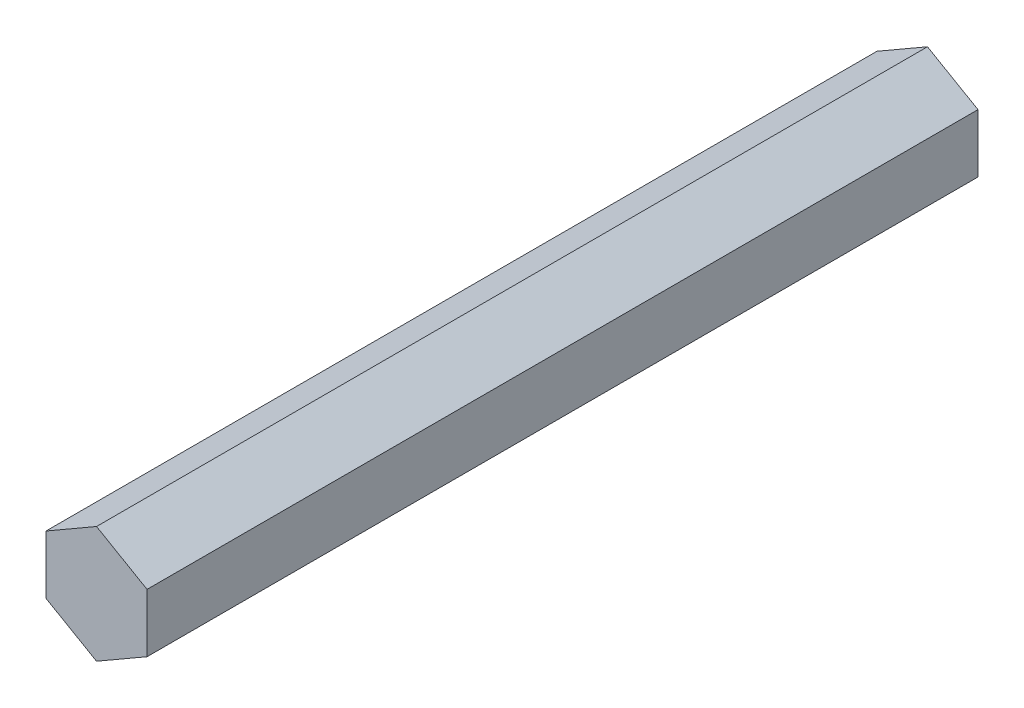
ISO-10303-21;
HEADER;
FILE_DESCRIPTION(('STEP AP214'),'2;1');
FILE_NAME('part.step','',(''),(''),'','','');
FILE_SCHEMA(('AUTOMOTIVE_DESIGN { 1 0 10303 214 1 1 1 1 }'));
ENDSEC;
DATA;
#1=APPLICATION_CONTEXT('core data for automotive mechanical design processes');
#2=APPLICATION_PROTOCOL_DEFINITION('international standard','automotive_design',2000,#1);
#3=PRODUCT_CONTEXT('',#1,'mechanical');
#4=PRODUCT('Part','Part','',(#3));
#5=PRODUCT_RELATED_PRODUCT_CATEGORY('part','',(#4));
#6=PRODUCT_DEFINITION_FORMATION('','',#4);
#7=PRODUCT_DEFINITION_CONTEXT('part definition',#1,'design');
#8=PRODUCT_DEFINITION('design','',#6,#7);
#9=PRODUCT_DEFINITION_SHAPE('','',#8);
#10=(LENGTH_UNIT() NAMED_UNIT(*) SI_UNIT(.MILLI.,.METRE.));
#11=(NAMED_UNIT(*) PLANE_ANGLE_UNIT() SI_UNIT($,.RADIAN.));
#12=(NAMED_UNIT(*) SI_UNIT($,.STERADIAN.) SOLID_ANGLE_UNIT());
#13=UNCERTAINTY_MEASURE_WITH_UNIT(LENGTH_MEASURE(1.E-05),#10,'distance_accuracy_value','');
#14=(GEOMETRIC_REPRESENTATION_CONTEXT(3) GLOBAL_UNCERTAINTY_ASSIGNED_CONTEXT((#13)) GLOBAL_UNIT_ASSIGNED_CONTEXT((#10,
#11,#12)) REPRESENTATION_CONTEXT('',''));
#15=CARTESIAN_POINT('',(0.,0.,0.));
#16=DIRECTION('',(0.,0.,1.));
#17=DIRECTION('',(1.,0.,0.));
#18=AXIS2_PLACEMENT_3D('',#15,#16,#17);
#19=CARTESIAN_POINT('',(2.25,0.,18.5));
#20=DIRECTION('',(-1.,0.,0.));
#21=DIRECTION('',(0.,-1.,0.));
#22=AXIS2_PLACEMENT_3D('',#19,#20,#21);
#23=PLANE('',#22);
#24=DIRECTION('',(0.,0.,-1.));
#25=VECTOR('',#24,1.);
#26=CARTESIAN_POINT('',(2.25,-1.29903810567666,18.5));
#27=LINE('',#26,#25);
#28=CARTESIAN_POINT('',(2.25,-1.29903810567666,18.5));
#29=VERTEX_POINT('',#28);
#30=CARTESIAN_POINT('',(2.25,-1.29903810567666,-18.5));
#31=VERTEX_POINT('',#30);
#32=EDGE_CURVE('E102',#29,#31,#27,.T.);
#33=ORIENTED_EDGE('',*,*,#32,.T.);
#34=DIRECTION('',(0.,1.,0.));
#35=VECTOR('',#34,1.);
#36=CARTESIAN_POINT('',(2.25,0.,-18.5));
#37=LINE('',#36,#35);
#38=CARTESIAN_POINT('',(2.25,1.29903810567666,-18.5));
#39=VERTEX_POINT('',#38);
#40=EDGE_CURVE('E96',#31,#39,#37,.T.);
#41=ORIENTED_EDGE('',*,*,#40,.T.);
#42=DIRECTION('',(0.,0.,-1.));
#43=VECTOR('',#42,1.);
#44=CARTESIAN_POINT('',(2.25,1.29903810567666,18.5));
#45=LINE('',#44,#43);
#46=CARTESIAN_POINT('',(2.25,1.29903810567666,18.5));
#47=VERTEX_POINT('',#46);
#48=EDGE_CURVE('E11',#47,#39,#45,.T.);
#49=ORIENTED_EDGE('',*,*,#48,.F.);
#50=DIRECTION('',(0.,1.,0.));
#51=VECTOR('',#50,1.);
#52=CARTESIAN_POINT('',(2.25,0.,18.5));
#53=LINE('',#52,#51);
#54=EDGE_CURVE('E114',#29,#47,#53,.T.);
#55=ORIENTED_EDGE('',*,*,#54,.F.);
#56=EDGE_LOOP('',(#33,#41,#49,#55));
#57=FACE_BOUND('',#56,.T.);
#58=ADVANCED_FACE('F32',(#57),#23,.F.);
#59=CARTESIAN_POINT('',(1.125,1.94855715851499,18.5));
#60=DIRECTION('',(-0.499999999999999,-0.866025403784439,0.));
#61=DIRECTION('',(0.866025403784439,-0.499999999999999,0.));
#62=AXIS2_PLACEMENT_3D('',#59,#60,#61);
#63=PLANE('',#62);
#64=ORIENTED_EDGE('',*,*,#48,.T.);
#65=DIRECTION('',(-0.866025403784439,0.499999999999999,0.));
#66=VECTOR('',#65,1.);
#67=CARTESIAN_POINT('',(1.125,1.94855715851499,-18.5));
#68=LINE('',#67,#66);
#69=CARTESIAN_POINT('',(0.,2.59807621135332,-18.5));
#70=VERTEX_POINT('',#69);
#71=EDGE_CURVE('E86',#39,#70,#68,.T.);
#72=ORIENTED_EDGE('',*,*,#71,.T.);
#73=DIRECTION('',(0.,0.,-1.));
#74=VECTOR('',#73,1.);
#75=CARTESIAN_POINT('',(0.,2.59807621135332,18.5));
#76=LINE('',#75,#74);
#77=CARTESIAN_POINT('',(0.,2.59807621135332,18.5));
#78=VERTEX_POINT('',#77);
#79=EDGE_CURVE('E39',#78,#70,#76,.T.);
#80=ORIENTED_EDGE('',*,*,#79,.F.);
#81=DIRECTION('',(-0.866025403784439,0.499999999999999,0.));
#82=VECTOR('',#81,1.);
#83=CARTESIAN_POINT('',(1.125,1.94855715851499,18.5));
#84=LINE('',#83,#82);
#85=EDGE_CURVE('E87',#47,#78,#84,.T.);
#86=ORIENTED_EDGE('',*,*,#85,.F.);
#87=EDGE_LOOP('',(#64,#72,#80,#86));
#88=FACE_BOUND('',#87,.T.);
#89=ADVANCED_FACE('F84',(#88),#63,.F.);
#90=CARTESIAN_POINT('',(-1.125,1.94855715851499,18.5));
#91=DIRECTION('',(0.5,-0.866025403784438,0.));
#92=DIRECTION('',(0.866025403784439,0.5,0.));
#93=AXIS2_PLACEMENT_3D('',#90,#91,#92);
#94=PLANE('',#93);
#95=ORIENTED_EDGE('',*,*,#79,.T.);
#96=DIRECTION('',(-0.866025403784439,-0.5,0.));
#97=VECTOR('',#96,1.);
#98=CARTESIAN_POINT('',(-1.125,1.94855715851499,-18.5));
#99=LINE('',#98,#97);
#100=CARTESIAN_POINT('',(-2.25,1.29903810567666,-18.5));
#101=VERTEX_POINT('',#100);
#102=EDGE_CURVE('E100',#70,#101,#99,.T.);
#103=ORIENTED_EDGE('',*,*,#102,.T.);
#104=DIRECTION('',(0.,0.,-1.));
#105=VECTOR('',#104,1.);
#106=CARTESIAN_POINT('',(-2.25,1.29903810567666,18.5));
#107=LINE('',#106,#105);
#108=CARTESIAN_POINT('',(-2.25,1.29903810567666,18.5));
#109=VERTEX_POINT('',#108);
#110=EDGE_CURVE('E128',#109,#101,#107,.T.);
#111=ORIENTED_EDGE('',*,*,#110,.F.);
#112=DIRECTION('',(-0.866025403784439,-0.5,0.));
#113=VECTOR('',#112,1.);
#114=CARTESIAN_POINT('',(-1.125,1.94855715851499,18.5));
#115=LINE('',#114,#113);
#116=EDGE_CURVE('E117',#78,#109,#115,.T.);
#117=ORIENTED_EDGE('',*,*,#116,.F.);
#118=EDGE_LOOP('',(#95,#103,#111,#117));
#119=FACE_BOUND('',#118,.T.);
#120=ADVANCED_FACE('F131',(#119),#94,.F.);
#121=CARTESIAN_POINT('',(-2.25,0.,18.5));
#122=DIRECTION('',(1.,0.,0.));
#123=DIRECTION('',(0.,1.,0.));
#124=AXIS2_PLACEMENT_3D('',#121,#122,#123);
#125=PLANE('',#124);
#126=ORIENTED_EDGE('',*,*,#110,.T.);
#127=DIRECTION('',(0.,-1.,0.));
#128=VECTOR('',#127,1.);
#129=CARTESIAN_POINT('',(-2.25,0.,-18.5));
#130=LINE('',#129,#128);
#131=CARTESIAN_POINT('',(-2.25,-1.29903810567666,-18.5));
#132=VERTEX_POINT('',#131);
#133=EDGE_CURVE('E106',#101,#132,#130,.T.);
#134=ORIENTED_EDGE('',*,*,#133,.T.);
#135=DIRECTION('',(0.,0.,-1.));
#136=VECTOR('',#135,1.);
#137=CARTESIAN_POINT('',(-2.25,-1.29903810567666,18.5));
#138=LINE('',#137,#136);
#139=CARTESIAN_POINT('',(-2.25,-1.29903810567666,18.5));
#140=VERTEX_POINT('',#139);
#141=EDGE_CURVE('E126',#140,#132,#138,.T.);
#142=ORIENTED_EDGE('',*,*,#141,.F.);
#143=DIRECTION('',(0.,-1.,0.));
#144=VECTOR('',#143,1.);
#145=CARTESIAN_POINT('',(-2.25,0.,18.5));
#146=LINE('',#145,#144);
#147=EDGE_CURVE('E119',#109,#140,#146,.T.);
#148=ORIENTED_EDGE('',*,*,#147,.F.);
#149=EDGE_LOOP('',(#126,#134,#142,#148));
#150=FACE_BOUND('',#149,.T.);
#151=ADVANCED_FACE('F137',(#150),#125,.F.);
#152=CARTESIAN_POINT('',(-1.125,-1.94855715851499,18.5));
#153=DIRECTION('',(0.5,0.866025403784439,0.));
#154=DIRECTION('',(-0.866025403784439,0.5,0.));
#155=AXIS2_PLACEMENT_3D('',#152,#153,#154);
#156=PLANE('',#155);
#157=ORIENTED_EDGE('',*,*,#141,.T.);
#158=DIRECTION('',(0.866025403784439,-0.5,0.));
#159=VECTOR('',#158,1.);
#160=CARTESIAN_POINT('',(-1.125,-1.94855715851499,-18.5));
#161=LINE('',#160,#159);
#162=CARTESIAN_POINT('',(0.,-2.59807621135332,-18.5));
#163=VERTEX_POINT('',#162);
#164=EDGE_CURVE('E109',#132,#163,#161,.T.);
#165=ORIENTED_EDGE('',*,*,#164,.T.);
#166=DIRECTION('',(0.,0.,-1.));
#167=VECTOR('',#166,1.);
#168=CARTESIAN_POINT('',(0.,-2.59807621135332,18.5));
#169=LINE('',#168,#167);
#170=CARTESIAN_POINT('',(0.,-2.59807621135332,18.5));
#171=VERTEX_POINT('',#170);
#172=EDGE_CURVE('E124',#171,#163,#169,.T.);
#173=ORIENTED_EDGE('',*,*,#172,.F.);
#174=DIRECTION('',(0.866025403784439,-0.5,0.));
#175=VECTOR('',#174,1.);
#176=CARTESIAN_POINT('',(-1.125,-1.94855715851499,18.5));
#177=LINE('',#176,#175);
#178=EDGE_CURVE('E51',#140,#171,#177,.T.);
#179=ORIENTED_EDGE('',*,*,#178,.F.);
#180=EDGE_LOOP('',(#157,#165,#173,#179));
#181=FACE_BOUND('',#180,.T.);
#182=ADVANCED_FACE('F140',(#181),#156,.F.);
#183=CARTESIAN_POINT('',(1.125,-1.94855715851499,18.5));
#184=DIRECTION('',(-0.5,0.866025403784438,0.));
#185=DIRECTION('',(-0.866025403784438,-0.5,0.));
#186=AXIS2_PLACEMENT_3D('',#183,#184,#185);
#187=PLANE('',#186);
#188=ORIENTED_EDGE('',*,*,#172,.T.);
#189=DIRECTION('',(0.866025403784438,0.5,0.));
#190=VECTOR('',#189,1.);
#191=CARTESIAN_POINT('',(1.125,-1.94855715851499,-18.5));
#192=LINE('',#191,#190);
#193=EDGE_CURVE('E112',#163,#31,#192,.T.);
#194=ORIENTED_EDGE('',*,*,#193,.T.);
#195=ORIENTED_EDGE('',*,*,#32,.F.);
#196=DIRECTION('',(0.866025403784438,0.5,0.));
#197=VECTOR('',#196,1.);
#198=CARTESIAN_POINT('',(1.125,-1.94855715851499,18.5));
#199=LINE('',#198,#197);
#200=EDGE_CURVE('E46',#171,#29,#199,.T.);
#201=ORIENTED_EDGE('',*,*,#200,.F.);
#202=EDGE_LOOP('',(#188,#194,#195,#201));
#203=FACE_BOUND('',#202,.T.);
#204=ADVANCED_FACE('F142',(#203),#187,.F.);
#205=CARTESIAN_POINT('',(0.,0.,18.5));
#206=DIRECTION('',(0.,0.,1.));
#207=DIRECTION('',(1.,0.,0.));
#208=AXIS2_PLACEMENT_3D('',#205,#206,#207);
#209=PLANE('',#208);
#210=ORIENTED_EDGE('',*,*,#54,.T.);
#211=ORIENTED_EDGE('',*,*,#85,.T.);
#212=ORIENTED_EDGE('',*,*,#116,.T.);
#213=ORIENTED_EDGE('',*,*,#147,.T.);
#214=ORIENTED_EDGE('',*,*,#178,.T.);
#215=ORIENTED_EDGE('',*,*,#200,.T.);
#216=EDGE_LOOP('',(#210,#211,#212,#213,#214,#215));
#217=FACE_BOUND('',#216,.T.);
#218=ADVANCED_FACE('F134',(#217),#209,.T.);
#219=CARTESIAN_POINT('',(0.,0.,-18.5));
#220=DIRECTION('',(0.,0.,1.));
#221=DIRECTION('',(1.,0.,0.));
#222=AXIS2_PLACEMENT_3D('',#219,#220,#221);
#223=PLANE('',#222);
#224=ORIENTED_EDGE('',*,*,#40,.F.);
#225=ORIENTED_EDGE('',*,*,#193,.F.);
#226=ORIENTED_EDGE('',*,*,#164,.F.);
#227=ORIENTED_EDGE('',*,*,#133,.F.);
#228=ORIENTED_EDGE('',*,*,#102,.F.);
#229=ORIENTED_EDGE('',*,*,#71,.F.);
#230=EDGE_LOOP('',(#224,#225,#226,#227,#228,#229));
#231=FACE_BOUND('',#230,.T.);
#232=ADVANCED_FACE('F94',(#231),#223,.F.);
#233=CLOSED_SHELL('',(#58,#89,#120,#151,#182,#204,#218,#232));
#234=MANIFOLD_SOLID_BREP('B2',#233);
#235=ADVANCED_BREP_SHAPE_REPRESENTATION('',(#18,#234),#14);
#236=SHAPE_DEFINITION_REPRESENTATION(#9,#235);
ENDSEC;
END-ISO-10303-21;
